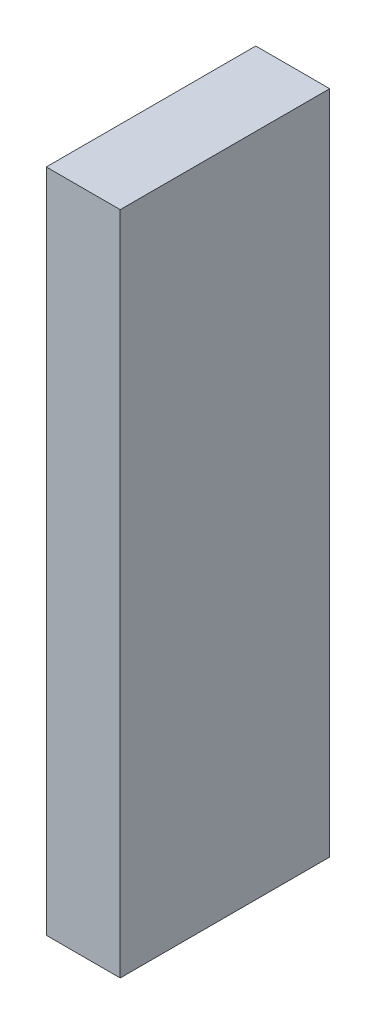
ISO-10303-21;
HEADER;
FILE_DESCRIPTION(('STEP AP214'),'2;1');
FILE_NAME('part.step','',(''),(''),'','','');
FILE_SCHEMA(('AUTOMOTIVE_DESIGN { 1 0 10303 214 1 1 1 1 }'));
ENDSEC;
DATA;
#1=APPLICATION_CONTEXT('core data for automotive mechanical design processes');
#2=APPLICATION_PROTOCOL_DEFINITION('international standard','automotive_design',2000,#1);
#3=PRODUCT_CONTEXT('',#1,'mechanical');
#4=PRODUCT('Part','Part','',(#3));
#5=PRODUCT_RELATED_PRODUCT_CATEGORY('part','',(#4));
#6=PRODUCT_DEFINITION_FORMATION('','',#4);
#7=PRODUCT_DEFINITION_CONTEXT('part definition',#1,'design');
#8=PRODUCT_DEFINITION('design','',#6,#7);
#9=PRODUCT_DEFINITION_SHAPE('','',#8);
#10=(LENGTH_UNIT() NAMED_UNIT(*) SI_UNIT(.MILLI.,.METRE.));
#11=(NAMED_UNIT(*) PLANE_ANGLE_UNIT() SI_UNIT($,.RADIAN.));
#12=(NAMED_UNIT(*) SI_UNIT($,.STERADIAN.) SOLID_ANGLE_UNIT());
#13=UNCERTAINTY_MEASURE_WITH_UNIT(LENGTH_MEASURE(1.E-05),#10,'distance_accuracy_value','');
#14=(GEOMETRIC_REPRESENTATION_CONTEXT(3) GLOBAL_UNCERTAINTY_ASSIGNED_CONTEXT((#13)) GLOBAL_UNIT_ASSIGNED_CONTEXT((#10,
#11,#12)) REPRESENTATION_CONTEXT('',''));
#15=CARTESIAN_POINT('',(0.,0.,0.));
#16=DIRECTION('',(0.,0.,1.));
#17=DIRECTION('',(1.,0.,0.));
#18=AXIS2_PLACEMENT_3D('',#15,#16,#17);
#19=CARTESIAN_POINT('',(2.44999064287444,2.7000014968407,0.));
#20=DIRECTION('',(-1.,8.74227765734759E-08,0.));
#21=DIRECTION('',(-8.74227765734759E-08,-1.,0.));
#22=AXIS2_PLACEMENT_3D('',#19,#20,#21);
#23=PLANE('',#22);
#24=DIRECTION('',(-8.74227765512293E-08,-0.999999999999996,0.));
#25=VECTOR('',#24,1.);
#26=CARTESIAN_POINT('',(2.44999064287444,2.7000014968407,0.));
#27=LINE('',#26,#25);
#28=CARTESIAN_POINT('',(2.44999064287444,2.7000014968407,0.));
#29=VERTEX_POINT('',#28);
#30=CARTESIAN_POINT('',(2.44999017079198,-2.69999239964368,0.));
#31=VERTEX_POINT('',#30);
#32=EDGE_CURVE('E11',#29,#31,#27,.T.);
#33=ORIENTED_EDGE('',*,*,#32,.T.);
#34=DIRECTION('',(0.,0.,1.));
#35=VECTOR('',#34,1.);
#36=CARTESIAN_POINT('',(2.44999017079198,-2.69999239964368,0.));
#37=LINE('',#36,#35);
#38=CARTESIAN_POINT('',(2.44999017079198,-2.69999239964368,1.6999990940094));
#39=VERTEX_POINT('',#38);
#40=EDGE_CURVE('E88',#31,#39,#37,.T.);
#41=ORIENTED_EDGE('',*,*,#40,.T.);
#42=DIRECTION('',(-8.74227765512293E-08,-0.999999999999996,0.));
#43=VECTOR('',#42,1.);
#44=CARTESIAN_POINT('',(2.44999064287444,2.7000014968407,1.6999990940094));
#45=LINE('',#44,#43);
#46=CARTESIAN_POINT('',(2.44999064287444,2.7000014968407,1.6999990940094));
#47=VERTEX_POINT('',#46);
#48=EDGE_CURVE('E83',#47,#39,#45,.T.);
#49=ORIENTED_EDGE('',*,*,#48,.F.);
#50=DIRECTION('',(0.,0.,1.));
#51=VECTOR('',#50,1.);
#52=CARTESIAN_POINT('',(2.44999064287444,2.7000014968407,0.));
#53=LINE('',#52,#51);
#54=EDGE_CURVE('E72',#29,#47,#53,.T.);
#55=ORIENTED_EDGE('',*,*,#54,.F.);
#56=EDGE_LOOP('',(#33,#41,#49,#55));
#57=FACE_BOUND('',#56,.T.);
#58=ADVANCED_FACE('F17',(#57),#23,.T.);
#59=CARTESIAN_POINT('',(2.44999017079198,-2.69999239964368,0.));
#60=DIRECTION('',(-8.74227765734759E-08,-1.,0.));
#61=DIRECTION('',(1.,-8.74227765734759E-08,0.));
#62=AXIS2_PLACEMENT_3D('',#59,#60,#61);
#63=PLANE('',#62);
#64=DIRECTION('',(0.999999999999996,-8.74227767736895E-08,0.));
#65=VECTOR('',#64,1.);
#66=CARTESIAN_POINT('',(2.44999017079198,-2.69999239964368,0.));
#67=LINE('',#66,#65);
#68=CARTESIAN_POINT('',(3.0499962743076,-2.69999245209787,0.));
#69=VERTEX_POINT('',#68);
#70=EDGE_CURVE('E24',#31,#69,#67,.T.);
#71=ORIENTED_EDGE('',*,*,#70,.T.);
#72=DIRECTION('',(0.,0.,1.));
#73=VECTOR('',#72,1.);
#74=CARTESIAN_POINT('',(3.0499962743076,-2.69999245209788,0.));
#75=LINE('',#74,#73);
#76=CARTESIAN_POINT('',(3.0499962743076,-2.69999245209787,1.6999990940094));
#77=VERTEX_POINT('',#76);
#78=EDGE_CURVE('E85',#69,#77,#75,.T.);
#79=ORIENTED_EDGE('',*,*,#78,.T.);
#80=DIRECTION('',(0.999999999999996,-8.74227767736895E-08,0.));
#81=VECTOR('',#80,1.);
#82=CARTESIAN_POINT('',(2.44999017079198,-2.69999239964368,1.6999990940094));
#83=LINE('',#82,#81);
#84=EDGE_CURVE('E66',#39,#77,#83,.T.);
#85=ORIENTED_EDGE('',*,*,#84,.F.);
#86=ORIENTED_EDGE('',*,*,#40,.F.);
#87=EDGE_LOOP('',(#71,#79,#85,#86));
#88=FACE_BOUND('',#87,.T.);
#89=ADVANCED_FACE('F89',(#88),#63,.T.);
#90=CARTESIAN_POINT('',(3.0499962743076,-2.69999245209787,0.));
#91=DIRECTION('',(1.,-8.74227765734759E-08,0.));
#92=DIRECTION('',(8.74227765734759E-08,1.,0.));
#93=AXIS2_PLACEMENT_3D('',#90,#91,#92);
#94=PLANE('',#93);
#95=DIRECTION('',(8.74227765512293E-08,0.999999999999996,0.));
#96=VECTOR('',#95,1.);
#97=CARTESIAN_POINT('',(3.0499962743076,-2.69999245209787,0.));
#98=LINE('',#97,#96);
#99=CARTESIAN_POINT('',(3.04999674639006,2.7000014443865,0.));
#100=VERTEX_POINT('',#99);
#101=EDGE_CURVE('E62',#69,#100,#98,.T.);
#102=ORIENTED_EDGE('',*,*,#101,.T.);
#103=DIRECTION('',(0.,0.,1.));
#104=VECTOR('',#103,1.);
#105=CARTESIAN_POINT('',(3.04999674639006,2.7000014443865,0.));
#106=LINE('',#105,#104);
#107=CARTESIAN_POINT('',(3.04999674639006,2.7000014443865,1.6999990940094));
#108=VERTEX_POINT('',#107);
#109=EDGE_CURVE('E55',#100,#108,#106,.T.);
#110=ORIENTED_EDGE('',*,*,#109,.T.);
#111=DIRECTION('',(8.74227765512293E-08,0.999999999999996,0.));
#112=VECTOR('',#111,1.);
#113=CARTESIAN_POINT('',(3.0499962743076,-2.69999245209787,1.6999990940094));
#114=LINE('',#113,#112);
#115=EDGE_CURVE('E59',#77,#108,#114,.T.);
#116=ORIENTED_EDGE('',*,*,#115,.F.);
#117=ORIENTED_EDGE('',*,*,#78,.F.);
#118=EDGE_LOOP('',(#102,#110,#116,#117));
#119=FACE_BOUND('',#118,.T.);
#120=ADVANCED_FACE('F57',(#119),#94,.T.);
#121=CARTESIAN_POINT('',(3.04999674639006,2.7000014443865,0.));
#122=DIRECTION('',(8.74227765734759E-08,1.,0.));
#123=DIRECTION('',(-1.,8.74227765734759E-08,0.));
#124=AXIS2_PLACEMENT_3D('',#121,#122,#123);
#125=PLANE('',#124);
#126=DIRECTION('',(-0.999999999999996,8.74227767736895E-08,0.));
#127=VECTOR('',#126,1.);
#128=CARTESIAN_POINT('',(3.04999674639006,2.7000014443865,0.));
#129=LINE('',#128,#127);
#130=EDGE_CURVE('E65',#100,#29,#129,.T.);
#131=ORIENTED_EDGE('',*,*,#130,.T.);
#132=ORIENTED_EDGE('',*,*,#54,.T.);
#133=DIRECTION('',(-0.999999999999996,8.74227767736895E-08,0.));
#134=VECTOR('',#133,1.);
#135=CARTESIAN_POINT('',(3.04999674639006,2.7000014443865,1.6999990940094));
#136=LINE('',#135,#134);
#137=EDGE_CURVE('E70',#108,#47,#136,.T.);
#138=ORIENTED_EDGE('',*,*,#137,.F.);
#139=ORIENTED_EDGE('',*,*,#109,.F.);
#140=EDGE_LOOP('',(#131,#132,#138,#139));
#141=FACE_BOUND('',#140,.T.);
#142=ADVANCED_FACE('F71',(#141),#125,.T.);
#143=CARTESIAN_POINT('',(141.75,74.8249893188477,1.6999990940094));
#144=DIRECTION('',(0.,0.,1.));
#145=DIRECTION('',(-1.,8.74227765734759E-08,0.));
#146=AXIS2_PLACEMENT_3D('',#143,#144,#145);
#147=PLANE('',#146);
#148=ORIENTED_EDGE('',*,*,#48,.T.);
#149=ORIENTED_EDGE('',*,*,#84,.T.);
#150=ORIENTED_EDGE('',*,*,#115,.T.);
#151=ORIENTED_EDGE('',*,*,#137,.T.);
#152=EDGE_LOOP('',(#148,#149,#150,#151));
#153=FACE_BOUND('',#152,.T.);
#154=ADVANCED_FACE('F76',(#153),#147,.T.);
#155=CARTESIAN_POINT('',(141.75,74.8249893188477,0.));
#156=DIRECTION('',(0.,0.,1.));
#157=DIRECTION('',(-1.,8.74227765734759E-08,0.));
#158=AXIS2_PLACEMENT_3D('',#155,#156,#157);
#159=PLANE('',#158);
#160=ORIENTED_EDGE('',*,*,#130,.F.);
#161=ORIENTED_EDGE('',*,*,#101,.F.);
#162=ORIENTED_EDGE('',*,*,#70,.F.);
#163=ORIENTED_EDGE('',*,*,#32,.F.);
#164=EDGE_LOOP('',(#160,#161,#162,#163));
#165=FACE_BOUND('',#164,.T.);
#166=ADVANCED_FACE('F91',(#165),#159,.F.);
#167=CLOSED_SHELL('',(#58,#89,#120,#142,#154,#166));
#168=MANIFOLD_SOLID_BREP('B1',#167);
#169=ADVANCED_BREP_SHAPE_REPRESENTATION('',(#18,#168),#14);
#170=SHAPE_DEFINITION_REPRESENTATION(#9,#169);
ENDSEC;
END-ISO-10303-21;
